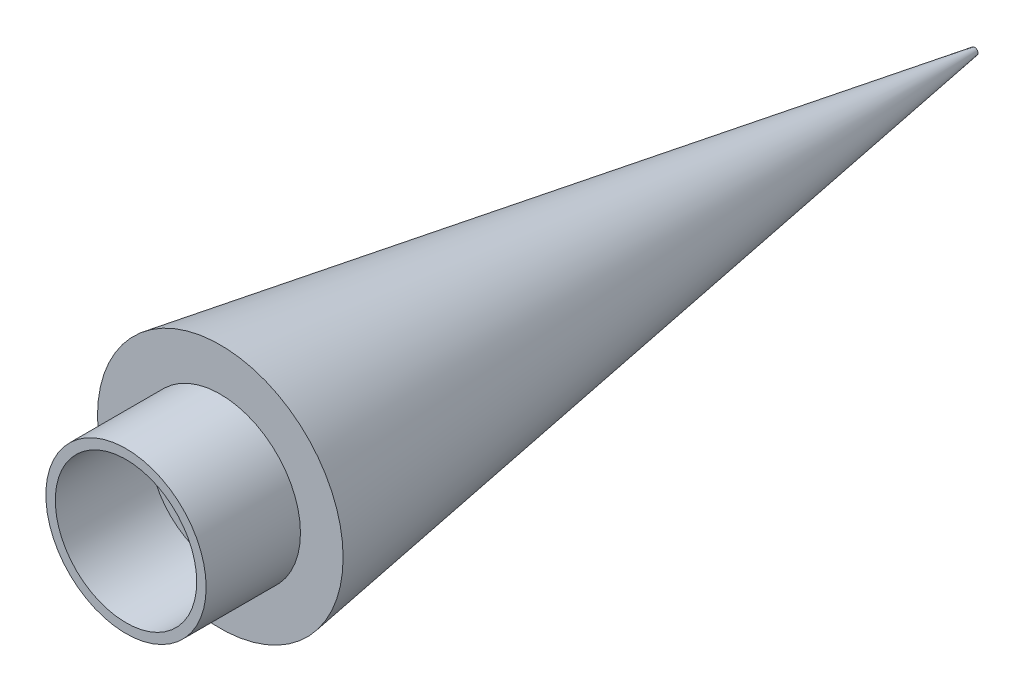
ISO-10303-21;
HEADER;
FILE_DESCRIPTION(('STEP AP214'),'2;1');
FILE_NAME('part.step','',(''),(''),'','','');
FILE_SCHEMA(('AUTOMOTIVE_DESIGN { 1 0 10303 214 1 1 1 1 }'));
ENDSEC;
DATA;
#1=APPLICATION_CONTEXT('core data for automotive mechanical design processes');
#2=APPLICATION_PROTOCOL_DEFINITION('international standard','automotive_design',2000,#1);
#3=PRODUCT_CONTEXT('',#1,'mechanical');
#4=PRODUCT('Part','Part','',(#3));
#5=PRODUCT_RELATED_PRODUCT_CATEGORY('part','',(#4));
#6=PRODUCT_DEFINITION_FORMATION('','',#4);
#7=PRODUCT_DEFINITION_CONTEXT('part definition',#1,'design');
#8=PRODUCT_DEFINITION('design','',#6,#7);
#9=PRODUCT_DEFINITION_SHAPE('','',#8);
#10=(LENGTH_UNIT() NAMED_UNIT(*) SI_UNIT(.MILLI.,.METRE.));
#11=(NAMED_UNIT(*) PLANE_ANGLE_UNIT() SI_UNIT($,.RADIAN.));
#12=(NAMED_UNIT(*) SI_UNIT($,.STERADIAN.) SOLID_ANGLE_UNIT());
#13=UNCERTAINTY_MEASURE_WITH_UNIT(LENGTH_MEASURE(1.E-05),#10,'distance_accuracy_value','');
#14=(GEOMETRIC_REPRESENTATION_CONTEXT(3) GLOBAL_UNCERTAINTY_ASSIGNED_CONTEXT((#13)) GLOBAL_UNIT_ASSIGNED_CONTEXT((#10,
#11,#12)) REPRESENTATION_CONTEXT('',''));
#15=CARTESIAN_POINT('',(0.,0.,0.));
#16=DIRECTION('',(0.,0.,1.));
#17=DIRECTION('',(1.,0.,0.));
#18=AXIS2_PLACEMENT_3D('',#15,#16,#17);
#19=CARTESIAN_POINT('',(0.,0.,75.));
#20=DIRECTION('',(0.,0.,1.));
#21=DIRECTION('',(1.,0.,0.));
#22=AXIS2_PLACEMENT_3D('',#19,#20,#21);
#23=PLANE('',#22);
#24=CARTESIAN_POINT('',(0.,0.,75.));
#25=DIRECTION('',(0.,0.,1.));
#26=DIRECTION('',(1.,0.,0.));
#27=AXIS2_PLACEMENT_3D('',#24,#25,#26);
#28=CIRCLE('',#27,63.75);
#29=CARTESIAN_POINT('',(63.75,0.,75.));
#30=VERTEX_POINT('',#29);
#31=EDGE_CURVE('E11',#30,#30,#28,.T.);
#32=ORIENTED_EDGE('',*,*,#31,.T.);
#33=EDGE_LOOP('',(#32));
#34=FACE_BOUND('',#33,.T.);
#35=CARTESIAN_POINT('',(0.,0.,75.));
#36=DIRECTION('',(0.,0.,1.));
#37=DIRECTION('',(1.,0.,0.));
#38=AXIS2_PLACEMENT_3D('',#35,#36,#37);
#39=CIRCLE('',#38,56.25);
#40=CARTESIAN_POINT('',(56.25,0.,75.));
#41=VERTEX_POINT('',#40);
#42=EDGE_CURVE('E44',#41,#41,#39,.T.);
#43=ORIENTED_EDGE('',*,*,#42,.F.);
#44=EDGE_LOOP('',(#43));
#45=FACE_BOUND('',#44,.T.);
#46=ADVANCED_FACE('F36',(#34,#45),#23,.T.);
#47=CARTESIAN_POINT('',(0.,0.,75.));
#48=DIRECTION('',(0.,0.,-1.));
#49=DIRECTION('',(-1.,0.,0.));
#50=AXIS2_PLACEMENT_3D('',#47,#48,#49);
#51=CYLINDRICAL_SURFACE('',#50,63.75);
#52=ORIENTED_EDGE('',*,*,#31,.F.);
#53=EDGE_LOOP('',(#52));
#54=FACE_BOUND('',#53,.T.);
#55=CARTESIAN_POINT('',(0.,0.,0.));
#56=DIRECTION('',(0.,0.,1.));
#57=DIRECTION('',(1.,0.,0.));
#58=AXIS2_PLACEMENT_3D('',#55,#56,#57);
#59=CIRCLE('',#58,63.75);
#60=CARTESIAN_POINT('',(63.75,0.,0.));
#61=VERTEX_POINT('',#60);
#62=EDGE_CURVE('E40',#61,#61,#59,.T.);
#63=ORIENTED_EDGE('',*,*,#62,.T.);
#64=EDGE_LOOP('',(#63));
#65=FACE_BOUND('',#64,.T.);
#66=ADVANCED_FACE('F38',(#54,#65),#51,.T.);
#67=CARTESIAN_POINT('',(0.,0.,75.));
#68=DIRECTION('',(0.,0.,-1.));
#69=DIRECTION('',(-1.,0.,0.));
#70=AXIS2_PLACEMENT_3D('',#67,#68,#69);
#71=CYLINDRICAL_SURFACE('',#70,56.25);
#72=ORIENTED_EDGE('',*,*,#42,.T.);
#73=EDGE_LOOP('',(#72));
#74=FACE_BOUND('',#73,.T.);
#75=CARTESIAN_POINT('',(0.,0.,0.));
#76=DIRECTION('',(0.,0.,1.));
#77=DIRECTION('',(1.,0.,0.));
#78=AXIS2_PLACEMENT_3D('',#75,#76,#77);
#79=CIRCLE('',#78,56.25);
#80=CARTESIAN_POINT('',(56.25,0.,0.));
#81=VERTEX_POINT('',#80);
#82=EDGE_CURVE('E48',#81,#81,#79,.T.);
#83=ORIENTED_EDGE('',*,*,#82,.F.);
#84=EDGE_LOOP('',(#83));
#85=FACE_BOUND('',#84,.T.);
#86=ADVANCED_FACE('F76',(#74,#85),#71,.F.);
#87=CARTESIAN_POINT('',(0.,0.,0.));
#88=DIRECTION('',(0.,0.,-1.));
#89=DIRECTION('',(-1.,0.,0.));
#90=AXIS2_PLACEMENT_3D('',#87,#88,#89);
#91=PLANE('',#90);
#92=ORIENTED_EDGE('',*,*,#82,.T.);
#93=EDGE_LOOP('',(#92));
#94=FACE_BOUND('',#93,.T.);
#95=ADVANCED_FACE('F67',(#94),#91,.F.);
#96=CARTESIAN_POINT('',(0.,0.,0.));
#97=DIRECTION('',(0.,0.,1.));
#98=DIRECTION('',(-1.,0.,0.));
#99=AXIS2_PLACEMENT_3D('',#96,#97,#98);
#100=CONICAL_SURFACE('',#99,97.6863806566155,0.15707963267949);
#101=CARTESIAN_POINT('',(0.,0.,-600.));
#102=DIRECTION('',(0.,0.,-1.));
#103=DIRECTION('',(-1.,0.,0.));
#104=AXIS2_PLACEMENT_3D('',#101,#102,#103);
#105=CIRCLE('',#104,2.65571646189366);
#106=CARTESIAN_POINT('',(-2.65571646189366,0.,-600.));
#107=VERTEX_POINT('',#106);
#108=EDGE_CURVE('E53',#107,#107,#105,.T.);
#109=ORIENTED_EDGE('',*,*,#108,.F.);
#110=EDGE_LOOP('',(#109));
#111=FACE_BOUND('',#110,.T.);
#112=CARTESIAN_POINT('',(0.,0.,0.));
#113=DIRECTION('',(0.,0.,-1.));
#114=DIRECTION('',(-1.,0.,0.));
#115=AXIS2_PLACEMENT_3D('',#112,#113,#114);
#116=CIRCLE('',#115,97.6863806566155);
#117=CARTESIAN_POINT('',(-97.6863806566155,0.,0.));
#118=VERTEX_POINT('',#117);
#119=EDGE_CURVE('E56',#118,#118,#116,.T.);
#120=ORIENTED_EDGE('',*,*,#119,.T.);
#121=EDGE_LOOP('',(#120));
#122=FACE_BOUND('',#121,.T.);
#123=ADVANCED_FACE('F60',(#111,#122),#100,.T.);
#124=CARTESIAN_POINT('',(0.,0.,-600.));
#125=DIRECTION('',(0.,0.,-1.));
#126=DIRECTION('',(-1.,0.,0.));
#127=AXIS2_PLACEMENT_3D('',#124,#125,#126);
#128=PLANE('',#127);
#129=ORIENTED_EDGE('',*,*,#108,.T.);
#130=EDGE_LOOP('',(#129));
#131=FACE_BOUND('',#130,.T.);
#132=ADVANCED_FACE('F64',(#131),#128,.T.);
#133=ORIENTED_EDGE('',*,*,#62,.F.);
#134=EDGE_LOOP('',(#133));
#135=FACE_BOUND('',#134,.T.);
#136=ORIENTED_EDGE('',*,*,#119,.F.);
#137=EDGE_LOOP('',(#136));
#138=FACE_BOUND('',#137,.T.);
#139=ADVANCED_FACE('F62',(#135,#138),#91,.F.);
#140=CLOSED_SHELL('',(#46,#66,#86,#95,#123,#132,#139));
#141=MANIFOLD_SOLID_BREP('B2',#140);
#142=ADVANCED_BREP_SHAPE_REPRESENTATION('',(#18,#141),#14);
#143=SHAPE_DEFINITION_REPRESENTATION(#9,#142);
ENDSEC;
END-ISO-10303-21;
